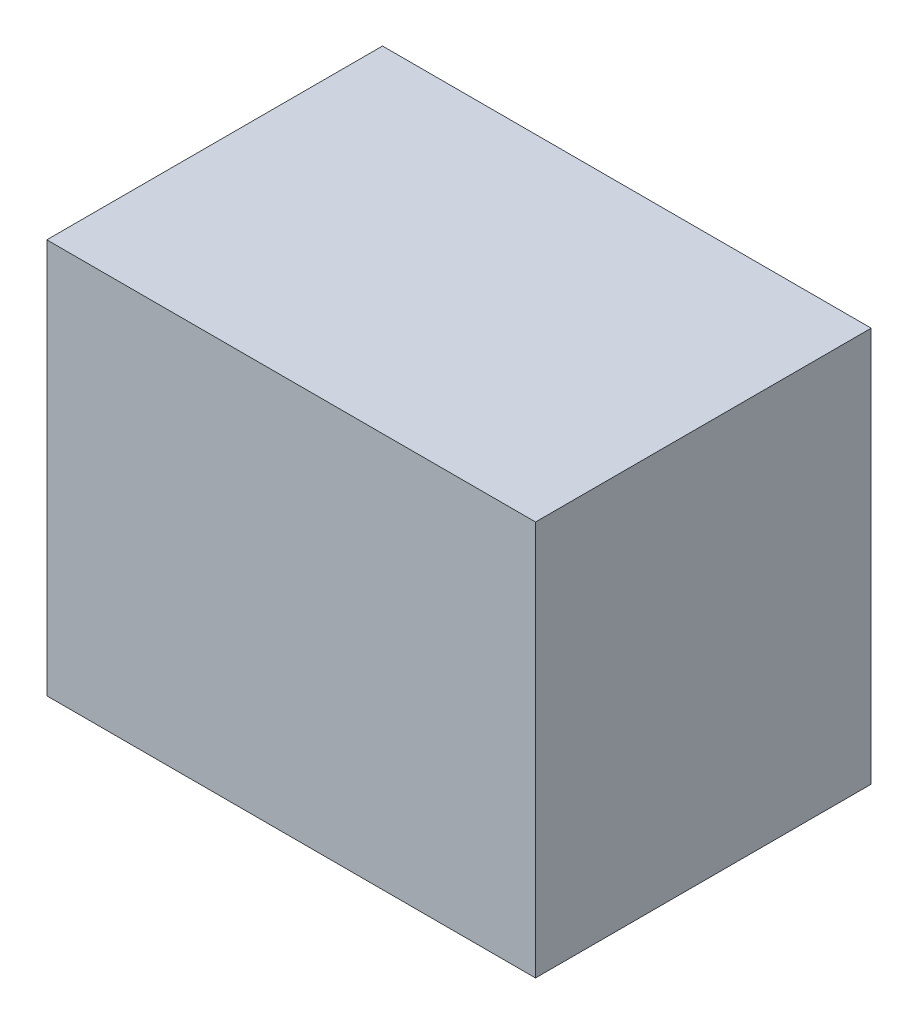
ISO-10303-21;
HEADER;
FILE_DESCRIPTION(('STEP AP214'),'2;1');
FILE_NAME('part.step','',(''),(''),'','','');
FILE_SCHEMA(('AUTOMOTIVE_DESIGN { 1 0 10303 214 1 1 1 1 }'));
ENDSEC;
DATA;
#1=APPLICATION_CONTEXT('core data for automotive mechanical design processes');
#2=APPLICATION_PROTOCOL_DEFINITION('international standard','automotive_design',2000,#1);
#3=PRODUCT_CONTEXT('',#1,'mechanical');
#4=PRODUCT('Part','Part','',(#3));
#5=PRODUCT_RELATED_PRODUCT_CATEGORY('part','',(#4));
#6=PRODUCT_DEFINITION_FORMATION('','',#4);
#7=PRODUCT_DEFINITION_CONTEXT('part definition',#1,'design');
#8=PRODUCT_DEFINITION('design','',#6,#7);
#9=PRODUCT_DEFINITION_SHAPE('','',#8);
#10=(LENGTH_UNIT() NAMED_UNIT(*) SI_UNIT(.MILLI.,.METRE.));
#11=(NAMED_UNIT(*) PLANE_ANGLE_UNIT() SI_UNIT($,.RADIAN.));
#12=(NAMED_UNIT(*) SI_UNIT($,.STERADIAN.) SOLID_ANGLE_UNIT());
#13=UNCERTAINTY_MEASURE_WITH_UNIT(LENGTH_MEASURE(1.E-05),#10,'distance_accuracy_value','');
#14=(GEOMETRIC_REPRESENTATION_CONTEXT(3) GLOBAL_UNCERTAINTY_ASSIGNED_CONTEXT((#13)) GLOBAL_UNIT_ASSIGNED_CONTEXT((#10,
#11,#12)) REPRESENTATION_CONTEXT('',''));
#15=CARTESIAN_POINT('',(0.,0.,0.));
#16=DIRECTION('',(0.,0.,1.));
#17=DIRECTION('',(1.,0.,0.));
#18=AXIS2_PLACEMENT_3D('',#15,#16,#17);
#19=CARTESIAN_POINT('',(495.,-200.,170.));
#20=DIRECTION('',(0.,0.,-1.));
#21=DIRECTION('',(-1.,0.,0.));
#22=AXIS2_PLACEMENT_3D('',#19,#20,#21);
#23=PLANE('',#22);
#24=DIRECTION('',(0.,-1.,0.));
#25=VECTOR('',#24,1.);
#26=CARTESIAN_POINT('',(0.,-200.,170.));
#27=LINE('',#26,#25);
#28=CARTESIAN_POINT('',(0.,200.,170.));
#29=VERTEX_POINT('',#28);
#30=CARTESIAN_POINT('',(0.,-200.,170.));
#31=VERTEX_POINT('',#30);
#32=EDGE_CURVE('E96',#29,#31,#27,.T.);
#33=ORIENTED_EDGE('',*,*,#32,.T.);
#34=DIRECTION('',(-1.,0.,0.));
#35=VECTOR('',#34,1.);
#36=CARTESIAN_POINT('',(495.,-200.,170.));
#37=LINE('',#36,#35);
#38=CARTESIAN_POINT('',(495.,-200.,170.));
#39=VERTEX_POINT('',#38);
#40=EDGE_CURVE('E11',#39,#31,#37,.T.);
#41=ORIENTED_EDGE('',*,*,#40,.F.);
#42=DIRECTION('',(0.,-1.,0.));
#43=VECTOR('',#42,1.);
#44=CARTESIAN_POINT('',(495.,-200.,170.));
#45=LINE('',#44,#43);
#46=CARTESIAN_POINT('',(495.,200.,170.));
#47=VERTEX_POINT('',#46);
#48=EDGE_CURVE('E84',#47,#39,#45,.T.);
#49=ORIENTED_EDGE('',*,*,#48,.F.);
#50=DIRECTION('',(-1.,0.,0.));
#51=VECTOR('',#50,1.);
#52=CARTESIAN_POINT('',(495.,200.,170.));
#53=LINE('',#52,#51);
#54=EDGE_CURVE('E92',#47,#29,#53,.T.);
#55=ORIENTED_EDGE('',*,*,#54,.T.);
#56=EDGE_LOOP('',(#33,#41,#49,#55));
#57=FACE_BOUND('',#56,.T.);
#58=ADVANCED_FACE('F33',(#57),#23,.F.);
#59=CARTESIAN_POINT('',(495.,-200.,-170.));
#60=DIRECTION('',(0.,1.,0.));
#61=DIRECTION('',(0.,0.,1.));
#62=AXIS2_PLACEMENT_3D('',#59,#60,#61);
#63=PLANE('',#62);
#64=DIRECTION('',(0.,0.,-1.));
#65=VECTOR('',#64,1.);
#66=CARTESIAN_POINT('',(0.,-200.,-170.));
#67=LINE('',#66,#65);
#68=CARTESIAN_POINT('',(0.,-200.,-170.));
#69=VERTEX_POINT('',#68);
#70=EDGE_CURVE('E88',#31,#69,#67,.T.);
#71=ORIENTED_EDGE('',*,*,#70,.T.);
#72=DIRECTION('',(-1.,0.,0.));
#73=VECTOR('',#72,1.);
#74=CARTESIAN_POINT('',(495.,-200.,-170.));
#75=LINE('',#74,#73);
#76=CARTESIAN_POINT('',(495.,-200.,-170.));
#77=VERTEX_POINT('',#76);
#78=EDGE_CURVE('E41',#77,#69,#75,.T.);
#79=ORIENTED_EDGE('',*,*,#78,.F.);
#80=DIRECTION('',(0.,0.,-1.));
#81=VECTOR('',#80,1.);
#82=CARTESIAN_POINT('',(495.,-200.,-170.));
#83=LINE('',#82,#81);
#84=EDGE_CURVE('E79',#39,#77,#83,.T.);
#85=ORIENTED_EDGE('',*,*,#84,.F.);
#86=ORIENTED_EDGE('',*,*,#40,.T.);
#87=EDGE_LOOP('',(#71,#79,#85,#86));
#88=FACE_BOUND('',#87,.T.);
#89=ADVANCED_FACE('F87',(#88),#63,.F.);
#90=CARTESIAN_POINT('',(495.,-200.,-170.));
#91=DIRECTION('',(0.,0.,1.));
#92=DIRECTION('',(1.,0.,0.));
#93=AXIS2_PLACEMENT_3D('',#90,#91,#92);
#94=PLANE('',#93);
#95=DIRECTION('',(0.,1.,0.));
#96=VECTOR('',#95,1.);
#97=CARTESIAN_POINT('',(0.,-200.,-170.));
#98=LINE('',#97,#96);
#99=CARTESIAN_POINT('',(0.,200.,-170.));
#100=VERTEX_POINT('',#99);
#101=EDGE_CURVE('E66',#69,#100,#98,.T.);
#102=ORIENTED_EDGE('',*,*,#101,.T.);
#103=DIRECTION('',(-1.,0.,0.));
#104=VECTOR('',#103,1.);
#105=CARTESIAN_POINT('',(495.,200.,-170.));
#106=LINE('',#105,#104);
#107=CARTESIAN_POINT('',(495.,200.,-170.));
#108=VERTEX_POINT('',#107);
#109=EDGE_CURVE('E89',#108,#100,#106,.T.);
#110=ORIENTED_EDGE('',*,*,#109,.F.);
#111=DIRECTION('',(0.,1.,0.));
#112=VECTOR('',#111,1.);
#113=CARTESIAN_POINT('',(495.,-200.,-170.));
#114=LINE('',#113,#112);
#115=EDGE_CURVE('E82',#77,#108,#114,.T.);
#116=ORIENTED_EDGE('',*,*,#115,.F.);
#117=ORIENTED_EDGE('',*,*,#78,.T.);
#118=EDGE_LOOP('',(#102,#110,#116,#117));
#119=FACE_BOUND('',#118,.T.);
#120=ADVANCED_FACE('F90',(#119),#94,.F.);
#121=CARTESIAN_POINT('',(495.,200.,-170.));
#122=DIRECTION('',(0.,-1.,0.));
#123=DIRECTION('',(0.,0.,-1.));
#124=AXIS2_PLACEMENT_3D('',#121,#122,#123);
#125=PLANE('',#124);
#126=DIRECTION('',(0.,0.,1.));
#127=VECTOR('',#126,1.);
#128=CARTESIAN_POINT('',(0.,200.,-170.));
#129=LINE('',#128,#127);
#130=EDGE_CURVE('E72',#100,#29,#129,.T.);
#131=ORIENTED_EDGE('',*,*,#130,.T.);
#132=ORIENTED_EDGE('',*,*,#54,.F.);
#133=DIRECTION('',(0.,0.,1.));
#134=VECTOR('',#133,1.);
#135=CARTESIAN_POINT('',(495.,200.,-170.));
#136=LINE('',#135,#134);
#137=EDGE_CURVE('E49',#108,#47,#136,.T.);
#138=ORIENTED_EDGE('',*,*,#137,.F.);
#139=ORIENTED_EDGE('',*,*,#109,.T.);
#140=EDGE_LOOP('',(#131,#132,#138,#139));
#141=FACE_BOUND('',#140,.T.);
#142=ADVANCED_FACE('F103',(#141),#125,.F.);
#143=CARTESIAN_POINT('',(495.,0.,0.));
#144=DIRECTION('',(1.,0.,0.));
#145=DIRECTION('',(0.,0.,-1.));
#146=AXIS2_PLACEMENT_3D('',#143,#144,#145);
#147=PLANE('',#146);
#148=ORIENTED_EDGE('',*,*,#48,.T.);
#149=ORIENTED_EDGE('',*,*,#84,.T.);
#150=ORIENTED_EDGE('',*,*,#115,.T.);
#151=ORIENTED_EDGE('',*,*,#137,.T.);
#152=EDGE_LOOP('',(#148,#149,#150,#151));
#153=FACE_BOUND('',#152,.T.);
#154=ADVANCED_FACE('F80',(#153),#147,.T.);
#155=CARTESIAN_POINT('',(0.,0.,0.));
#156=DIRECTION('',(1.,0.,0.));
#157=DIRECTION('',(0.,0.,-1.));
#158=AXIS2_PLACEMENT_3D('',#155,#156,#157);
#159=PLANE('',#158);
#160=ORIENTED_EDGE('',*,*,#32,.F.);
#161=ORIENTED_EDGE('',*,*,#130,.F.);
#162=ORIENTED_EDGE('',*,*,#101,.F.);
#163=ORIENTED_EDGE('',*,*,#70,.F.);
#164=EDGE_LOOP('',(#160,#161,#162,#163));
#165=FACE_BOUND('',#164,.T.);
#166=ADVANCED_FACE('F106',(#165),#159,.F.);
#167=CLOSED_SHELL('',(#58,#89,#120,#142,#154,#166));
#168=MANIFOLD_SOLID_BREP('B2',#167);
#169=ADVANCED_BREP_SHAPE_REPRESENTATION('',(#18,#168),#14);
#170=SHAPE_DEFINITION_REPRESENTATION(#9,#169);
ENDSEC;
END-ISO-10303-21;
